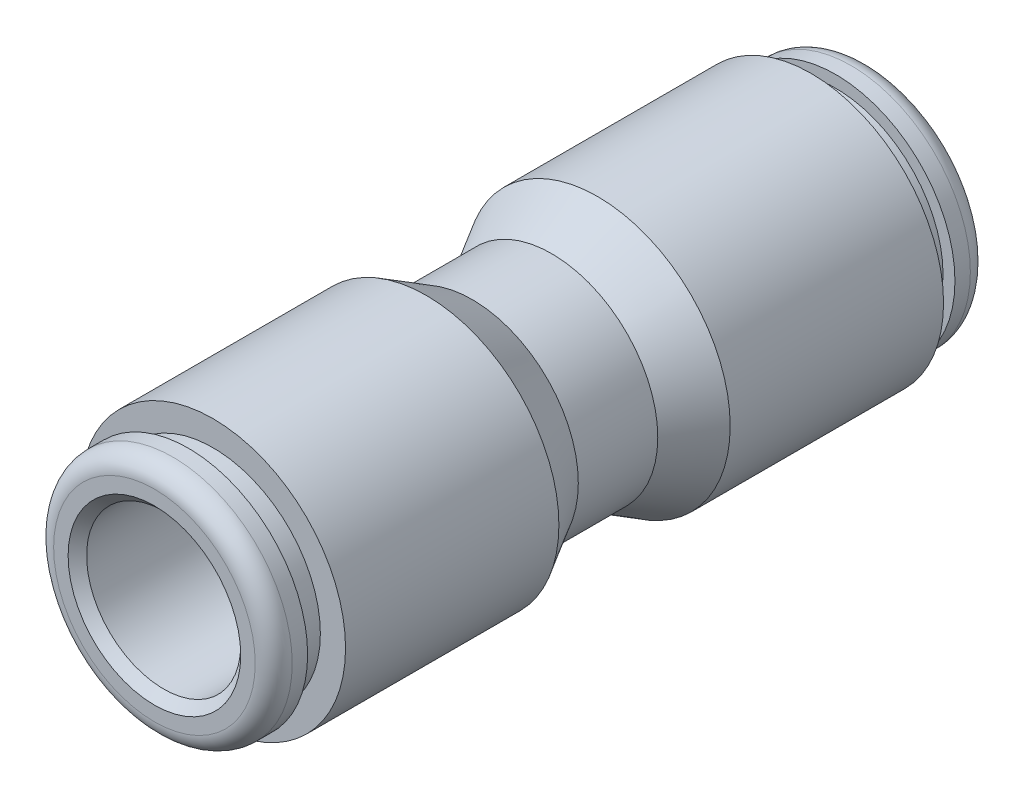
ISO-10303-21;
HEADER;
FILE_DESCRIPTION(('STEP AP214'),'2;1');
FILE_NAME('part.step','',(''),(''),'','','');
FILE_SCHEMA(('AUTOMOTIVE_DESIGN { 1 0 10303 214 1 1 1 1 }'));
ENDSEC;
DATA;
#1=APPLICATION_CONTEXT('core data for automotive mechanical design processes');
#2=APPLICATION_PROTOCOL_DEFINITION('international standard','automotive_design',2000,#1);
#3=PRODUCT_CONTEXT('',#1,'mechanical');
#4=PRODUCT('Part','Part','',(#3));
#5=PRODUCT_RELATED_PRODUCT_CATEGORY('part','',(#4));
#6=PRODUCT_DEFINITION_FORMATION('','',#4);
#7=PRODUCT_DEFINITION_CONTEXT('part definition',#1,'design');
#8=PRODUCT_DEFINITION('design','',#6,#7);
#9=PRODUCT_DEFINITION_SHAPE('','',#8);
#10=(LENGTH_UNIT() NAMED_UNIT(*) SI_UNIT(.MILLI.,.METRE.));
#11=(NAMED_UNIT(*) PLANE_ANGLE_UNIT() SI_UNIT($,.RADIAN.));
#12=(NAMED_UNIT(*) SI_UNIT($,.STERADIAN.) SOLID_ANGLE_UNIT());
#13=UNCERTAINTY_MEASURE_WITH_UNIT(LENGTH_MEASURE(1.E-05),#10,'distance_accuracy_value','');
#14=(GEOMETRIC_REPRESENTATION_CONTEXT(3) GLOBAL_UNCERTAINTY_ASSIGNED_CONTEXT((#13)) GLOBAL_UNIT_ASSIGNED_CONTEXT((#10,
#11,#12)) REPRESENTATION_CONTEXT('',''));
#15=CARTESIAN_POINT('',(0.,0.,0.));
#16=DIRECTION('',(0.,0.,1.));
#17=DIRECTION('',(1.,0.,0.));
#18=AXIS2_PLACEMENT_3D('',#15,#16,#17);
#19=CARTESIAN_POINT('',(0.,4.3688,0.));
#20=DIRECTION('',(0.,0.,-1.));
#21=DIRECTION('',(-1.,0.,0.));
#22=AXIS2_PLACEMENT_3D('',#19,#20,#21);
#23=PLANE('',#22);
#24=CARTESIAN_POINT('',(0.,0.,0.));
#25=DIRECTION('',(0.,0.,1.));
#26=DIRECTION('',(1.,0.,0.));
#27=AXIS2_PLACEMENT_3D('',#24,#25,#26);
#28=CIRCLE('',#27,2.413);
#29=CARTESIAN_POINT('',(2.413,0.,0.));
#30=VERTEX_POINT('',#29);
#31=EDGE_CURVE('E77',#30,#30,#28,.T.);
#32=ORIENTED_EDGE('',*,*,#31,.F.);
#33=EDGE_LOOP('',(#32));
#34=FACE_BOUND('',#33,.T.);
#35=CARTESIAN_POINT('',(0.,0.,0.));
#36=DIRECTION('',(0.,0.,-1.));
#37=DIRECTION('',(-1.,0.,0.));
#38=AXIS2_PLACEMENT_3D('',#35,#36,#37);
#39=CIRCLE('',#38,3.175);
#40=CARTESIAN_POINT('',(-3.175,0.,0.));
#41=VERTEX_POINT('',#40);
#42=EDGE_CURVE('E10',#41,#41,#39,.T.);
#43=ORIENTED_EDGE('',*,*,#42,.F.);
#44=EDGE_LOOP('',(#43));
#45=FACE_BOUND('',#44,.T.);
#46=ADVANCED_FACE('F30',(#34,#45),#23,.F.);
#47=CARTESIAN_POINT('',(0.,0.,0.));
#48=DIRECTION('',(0.,0.,1.));
#49=DIRECTION('',(1.,0.,0.));
#50=AXIS2_PLACEMENT_3D('',#47,#48,#49);
#51=CYLINDRICAL_SURFACE('',#50,3.175);
#52=CARTESIAN_POINT('',(0.,0.,-14.351));
#53=DIRECTION('',(0.,0.,1.));
#54=DIRECTION('',(1.,0.,0.));
#55=AXIS2_PLACEMENT_3D('',#52,#53,#54);
#56=CIRCLE('',#55,3.175);
#57=CARTESIAN_POINT('',(3.175,0.,-14.351));
#58=VERTEX_POINT('',#57);
#59=EDGE_CURVE('E71',#58,#58,#56,.T.);
#60=ORIENTED_EDGE('',*,*,#59,.F.);
#61=EDGE_LOOP('',(#60));
#62=FACE_BOUND('',#61,.T.);
#63=CARTESIAN_POINT('',(0.,0.,-1.016));
#64=DIRECTION('',(0.,0.,1.));
#65=DIRECTION('',(1.,0.,0.));
#66=AXIS2_PLACEMENT_3D('',#63,#64,#65);
#67=CIRCLE('',#66,3.175);
#68=CARTESIAN_POINT('',(3.175,0.,-1.016));
#69=VERTEX_POINT('',#68);
#70=EDGE_CURVE('E37',#69,#69,#67,.F.);
#71=ORIENTED_EDGE('',*,*,#70,.F.);
#72=EDGE_LOOP('',(#71));
#73=FACE_BOUND('',#72,.T.);
#74=ADVANCED_FACE('F32',(#62,#73),#51,.F.);
#75=CARTESIAN_POINT('',(0.,0.,0.));
#76=DIRECTION('',(0.,0.,1.));
#77=DIRECTION('',(1.,0.,0.));
#78=AXIS2_PLACEMENT_3D('',#75,#76,#77);
#79=CYLINDRICAL_SURFACE('',#78,4.3688);
#80=CARTESIAN_POINT('',(0.,0.,-1.63688888888889));
#81=DIRECTION('',(0.,0.,1.));
#82=DIRECTION('',(1.,0.,0.));
#83=AXIS2_PLACEMENT_3D('',#80,#81,#82);
#84=CIRCLE('',#83,4.3688);
#85=CARTESIAN_POINT('',(4.3688,0.,-1.63688888888889));
#86=VERTEX_POINT('',#85);
#87=EDGE_CURVE('E41',#86,#86,#84,.T.);
#88=ORIENTED_EDGE('',*,*,#87,.T.);
#89=EDGE_LOOP('',(#88));
#90=FACE_BOUND('',#89,.T.);
#91=CARTESIAN_POINT('',(0.,0.,1.63688888888889));
#92=DIRECTION('',(0.,0.,1.));
#93=DIRECTION('',(1.,0.,0.));
#94=AXIS2_PLACEMENT_3D('',#91,#92,#93);
#95=CIRCLE('',#94,4.3688);
#96=CARTESIAN_POINT('',(4.3688,0.,1.63688888888889));
#97=VERTEX_POINT('',#96);
#98=EDGE_CURVE('E80',#97,#97,#95,.T.);
#99=ORIENTED_EDGE('',*,*,#98,.F.);
#100=EDGE_LOOP('',(#99));
#101=FACE_BOUND('',#100,.T.);
#102=ADVANCED_FACE('F129',(#90,#101),#79,.T.);
#103=CARTESIAN_POINT('',(0.,0.,-3.52863478091561));
#104=DIRECTION('',(0.,0.,-1.));
#105=DIRECTION('',(-1.,0.,0.));
#106=AXIS2_PLACEMENT_3D('',#103,#104,#105);
#107=CONICAL_SURFACE('',#106,5.461,0.523598775598301);
#108=ORIENTED_EDGE('',*,*,#87,.F.);
#109=EDGE_LOOP('',(#108));
#110=FACE_BOUND('',#109,.T.);
#111=CARTESIAN_POINT('',(0.,0.,-3.52863478091561));
#112=DIRECTION('',(0.,0.,1.));
#113=DIRECTION('',(1.,0.,0.));
#114=AXIS2_PLACEMENT_3D('',#111,#112,#113);
#115=CIRCLE('',#114,5.461);
#116=CARTESIAN_POINT('',(5.461,0.,-3.52863478091561));
#117=VERTEX_POINT('',#116);
#118=EDGE_CURVE('E45',#117,#117,#115,.T.);
#119=ORIENTED_EDGE('',*,*,#118,.T.);
#120=EDGE_LOOP('',(#119));
#121=FACE_BOUND('',#120,.T.);
#122=ADVANCED_FACE('F136',(#110,#121),#107,.T.);
#123=CARTESIAN_POINT('',(0.,0.,0.));
#124=DIRECTION('',(0.,0.,1.));
#125=DIRECTION('',(1.,0.,0.));
#126=AXIS2_PLACEMENT_3D('',#123,#124,#125);
#127=CYLINDRICAL_SURFACE('',#126,5.461);
#128=ORIENTED_EDGE('',*,*,#118,.F.);
#129=EDGE_LOOP('',(#128));
#130=FACE_BOUND('',#129,.T.);
#131=CARTESIAN_POINT('',(0.,0.,-12.319));
#132=DIRECTION('',(0.,0.,1.));
#133=DIRECTION('',(1.,0.,0.));
#134=AXIS2_PLACEMENT_3D('',#131,#132,#133);
#135=CIRCLE('',#134,5.461);
#136=CARTESIAN_POINT('',(5.461,0.,-12.319));
#137=VERTEX_POINT('',#136);
#138=EDGE_CURVE('E50',#137,#137,#135,.T.);
#139=ORIENTED_EDGE('',*,*,#138,.T.);
#140=EDGE_LOOP('',(#139));
#141=FACE_BOUND('',#140,.T.);
#142=ADVANCED_FACE('F140',(#130,#141),#127,.T.);
#143=CARTESIAN_POINT('',(0.,5.461,-12.319));
#144=DIRECTION('',(0.,0.,1.));
#145=DIRECTION('',(1.,0.,0.));
#146=AXIS2_PLACEMENT_3D('',#143,#144,#145);
#147=PLANE('',#146);
#148=ORIENTED_EDGE('',*,*,#138,.F.);
#149=EDGE_LOOP('',(#148));
#150=FACE_BOUND('',#149,.T.);
#151=CARTESIAN_POINT('',(0.,0.,-12.319));
#152=DIRECTION('',(0.,0.,1.));
#153=DIRECTION('',(1.,0.,0.));
#154=AXIS2_PLACEMENT_3D('',#151,#152,#153);
#155=CIRCLE('',#154,4.42341);
#156=CARTESIAN_POINT('',(4.42341,0.,-12.319));
#157=VERTEX_POINT('',#156);
#158=EDGE_CURVE('E53',#157,#157,#155,.T.);
#159=ORIENTED_EDGE('',*,*,#158,.T.);
#160=EDGE_LOOP('',(#159));
#161=FACE_BOUND('',#160,.T.);
#162=ADVANCED_FACE('F144',(#150,#161),#147,.F.);
#163=CARTESIAN_POINT('',(0.,0.,0.));
#164=DIRECTION('',(0.,0.,1.));
#165=DIRECTION('',(1.,0.,0.));
#166=AXIS2_PLACEMENT_3D('',#163,#164,#165);
#167=CYLINDRICAL_SURFACE('',#166,4.42341);
#168=ORIENTED_EDGE('',*,*,#158,.F.);
#169=EDGE_LOOP('',(#168));
#170=FACE_BOUND('',#169,.T.);
#171=CARTESIAN_POINT('',(0.,0.,-13.335));
#172=DIRECTION('',(0.,0.,1.));
#173=DIRECTION('',(1.,0.,0.));
#174=AXIS2_PLACEMENT_3D('',#171,#172,#173);
#175=CIRCLE('',#174,4.42341);
#176=CARTESIAN_POINT('',(4.42341,0.,-13.335));
#177=VERTEX_POINT('',#176);
#178=EDGE_CURVE('E56',#177,#177,#175,.T.);
#179=ORIENTED_EDGE('',*,*,#178,.T.);
#180=EDGE_LOOP('',(#179));
#181=FACE_BOUND('',#180,.T.);
#182=ADVANCED_FACE('F148',(#170,#181),#167,.T.);
#183=CARTESIAN_POINT('',(0.,4.9149,-13.335));
#184=DIRECTION('',(0.,0.,-1.));
#185=DIRECTION('',(-1.,0.,0.));
#186=AXIS2_PLACEMENT_3D('',#183,#184,#185);
#187=PLANE('',#186);
#188=ORIENTED_EDGE('',*,*,#178,.F.);
#189=EDGE_LOOP('',(#188));
#190=FACE_BOUND('',#189,.T.);
#191=CARTESIAN_POINT('',(0.,0.,-13.335));
#192=DIRECTION('',(0.,0.,1.));
#193=DIRECTION('',(1.,0.,0.));
#194=AXIS2_PLACEMENT_3D('',#191,#192,#193);
#195=CIRCLE('',#194,4.9149);
#196=CARTESIAN_POINT('',(4.9149,0.,-13.335));
#197=VERTEX_POINT('',#196);
#198=EDGE_CURVE('E59',#197,#197,#195,.T.);
#199=ORIENTED_EDGE('',*,*,#198,.T.);
#200=EDGE_LOOP('',(#199));
#201=FACE_BOUND('',#200,.T.);
#202=ADVANCED_FACE('F152',(#190,#201),#187,.F.);
#203=CARTESIAN_POINT('',(0.,0.,0.));
#204=DIRECTION('',(0.,0.,1.));
#205=DIRECTION('',(1.,0.,0.));
#206=AXIS2_PLACEMENT_3D('',#203,#204,#205);
#207=CYLINDRICAL_SURFACE('',#206,4.9149);
#208=ORIENTED_EDGE('',*,*,#198,.F.);
#209=EDGE_LOOP('',(#208));
#210=FACE_BOUND('',#209,.T.);
#211=CARTESIAN_POINT('',(0.,0.,-13.97));
#212=DIRECTION('',(0.,0.,1.));
#213=DIRECTION('',(1.,0.,0.));
#214=AXIS2_PLACEMENT_3D('',#211,#212,#213);
#215=CIRCLE('',#214,4.9149);
#216=CARTESIAN_POINT('',(4.9149,0.,-13.97));
#217=VERTEX_POINT('',#216);
#218=EDGE_CURVE('E62',#217,#217,#215,.T.);
#219=ORIENTED_EDGE('',*,*,#218,.T.);
#220=EDGE_LOOP('',(#219));
#221=FACE_BOUND('',#220,.T.);
#222=ADVANCED_FACE('F156',(#210,#221),#207,.T.);
#223=CARTESIAN_POINT('',(0.,0.,-13.97));
#224=DIRECTION('',(0.,0.,1.));
#225=DIRECTION('',(1.,0.,0.));
#226=AXIS2_PLACEMENT_3D('',#223,#224,#225);
#227=TOROIDAL_SURFACE('',#226,4.1529,0.762);
#228=ORIENTED_EDGE('',*,*,#218,.F.);
#229=EDGE_LOOP('',(#228));
#230=FACE_BOUND('',#229,.T.);
#231=CARTESIAN_POINT('',(0.,0.,-14.732));
#232=DIRECTION('',(0.,0.,1.));
#233=DIRECTION('',(1.,0.,0.));
#234=AXIS2_PLACEMENT_3D('',#231,#232,#233);
#235=CIRCLE('',#234,4.1529);
#236=CARTESIAN_POINT('',(4.1529,0.,-14.732));
#237=VERTEX_POINT('',#236);
#238=EDGE_CURVE('E65',#237,#237,#235,.T.);
#239=ORIENTED_EDGE('',*,*,#238,.T.);
#240=EDGE_LOOP('',(#239));
#241=FACE_BOUND('',#240,.T.);
#242=ADVANCED_FACE('F160',(#230,#241),#227,.T.);
#243=CARTESIAN_POINT('',(0.,4.1529,-14.732));
#244=DIRECTION('',(0.,0.,1.));
#245=DIRECTION('',(1.,0.,0.));
#246=AXIS2_PLACEMENT_3D('',#243,#244,#245);
#247=PLANE('',#246);
#248=ORIENTED_EDGE('',*,*,#238,.F.);
#249=EDGE_LOOP('',(#248));
#250=FACE_BOUND('',#249,.T.);
#251=CARTESIAN_POINT('',(0.,0.,-14.732));
#252=DIRECTION('',(0.,0.,1.));
#253=DIRECTION('',(1.,0.,0.));
#254=AXIS2_PLACEMENT_3D('',#251,#252,#253);
#255=CIRCLE('',#254,3.556);
#256=CARTESIAN_POINT('',(3.556,0.,-14.732));
#257=VERTEX_POINT('',#256);
#258=EDGE_CURVE('E68',#257,#257,#255,.T.);
#259=ORIENTED_EDGE('',*,*,#258,.T.);
#260=EDGE_LOOP('',(#259));
#261=FACE_BOUND('',#260,.T.);
#262=ADVANCED_FACE('F164',(#250,#261),#247,.F.);
#263=CARTESIAN_POINT('',(0.,0.,-14.351));
#264=DIRECTION('',(0.,0.,-1.));
#265=DIRECTION('',(-1.,0.,0.));
#266=AXIS2_PLACEMENT_3D('',#263,#264,#265);
#267=CONICAL_SURFACE('',#266,3.175,0.785398163397449);
#268=ORIENTED_EDGE('',*,*,#258,.F.);
#269=EDGE_LOOP('',(#268));
#270=FACE_BOUND('',#269,.T.);
#271=ORIENTED_EDGE('',*,*,#59,.T.);
#272=EDGE_LOOP('',(#271));
#273=FACE_BOUND('',#272,.T.);
#274=ADVANCED_FACE('F168',(#270,#273),#267,.F.);
#275=CARTESIAN_POINT('',(0.,0.,-1.016));
#276=DIRECTION('',(0.,0.,1.));
#277=DIRECTION('',(1.,0.,0.));
#278=AXIS2_PLACEMENT_3D('',#275,#276,#277);
#279=PLANE('',#278);
#280=CARTESIAN_POINT('',(0.,0.,-1.016));
#281=DIRECTION('',(0.,0.,1.));
#282=DIRECTION('',(1.,0.,0.));
#283=AXIS2_PLACEMENT_3D('',#280,#281,#282);
#284=CIRCLE('',#283,2.413);
#285=CARTESIAN_POINT('',(2.413,0.,-1.016));
#286=VERTEX_POINT('',#285);
#287=EDGE_CURVE('E74',#286,#286,#284,.T.);
#288=ORIENTED_EDGE('',*,*,#287,.T.);
#289=EDGE_LOOP('',(#288));
#290=FACE_BOUND('',#289,.T.);
#291=ORIENTED_EDGE('',*,*,#70,.T.);
#292=EDGE_LOOP('',(#291));
#293=FACE_BOUND('',#292,.T.);
#294=ADVANCED_FACE('F172',(#290,#293),#279,.F.);
#295=CARTESIAN_POINT('',(0.,0.,-1.016));
#296=DIRECTION('',(0.,0.,1.));
#297=DIRECTION('',(1.,0.,0.));
#298=AXIS2_PLACEMENT_3D('',#295,#296,#297);
#299=CYLINDRICAL_SURFACE('',#298,2.413);
#300=ORIENTED_EDGE('',*,*,#287,.F.);
#301=EDGE_LOOP('',(#300));
#302=FACE_BOUND('',#301,.T.);
#303=ORIENTED_EDGE('',*,*,#31,.T.);
#304=EDGE_LOOP('',(#303));
#305=FACE_BOUND('',#304,.T.);
#306=ADVANCED_FACE('F176',(#302,#305),#299,.F.);
#307=CARTESIAN_POINT('',(0.,0.,0.));
#308=DIRECTION('',(0.,0.,-1.));
#309=DIRECTION('',(1.,0.,0.));
#310=AXIS2_PLACEMENT_3D('',#307,#308,#309);
#311=CYLINDRICAL_SURFACE('',#310,3.175);
#312=CARTESIAN_POINT('',(0.,0.,14.351));
#313=DIRECTION('',(0.,0.,1.));
#314=DIRECTION('',(1.,0.,0.));
#315=AXIS2_PLACEMENT_3D('',#312,#313,#314);
#316=CIRCLE('',#315,3.175);
#317=CARTESIAN_POINT('',(3.175,0.,14.351));
#318=VERTEX_POINT('',#317);
#319=EDGE_CURVE('E107',#318,#318,#316,.T.);
#320=ORIENTED_EDGE('',*,*,#319,.T.);
#321=EDGE_LOOP('',(#320));
#322=FACE_BOUND('',#321,.T.);
#323=ORIENTED_EDGE('',*,*,#42,.T.);
#324=EDGE_LOOP('',(#323));
#325=FACE_BOUND('',#324,.T.);
#326=ADVANCED_FACE('F111',(#322,#325),#311,.F.);
#327=CARTESIAN_POINT('',(0.,0.,3.52863478091561));
#328=DIRECTION('',(0.,0.,1.));
#329=DIRECTION('',(-1.,0.,0.));
#330=AXIS2_PLACEMENT_3D('',#327,#328,#329);
#331=CONICAL_SURFACE('',#330,5.461,0.523598775598301);
#332=ORIENTED_EDGE('',*,*,#98,.T.);
#333=EDGE_LOOP('',(#332));
#334=FACE_BOUND('',#333,.T.);
#335=CARTESIAN_POINT('',(0.,0.,3.52863478091561));
#336=DIRECTION('',(0.,0.,1.));
#337=DIRECTION('',(1.,0.,0.));
#338=AXIS2_PLACEMENT_3D('',#335,#336,#337);
#339=CIRCLE('',#338,5.461);
#340=CARTESIAN_POINT('',(5.461,0.,3.52863478091561));
#341=VERTEX_POINT('',#340);
#342=EDGE_CURVE('E83',#341,#341,#339,.T.);
#343=ORIENTED_EDGE('',*,*,#342,.F.);
#344=EDGE_LOOP('',(#343));
#345=FACE_BOUND('',#344,.T.);
#346=ADVANCED_FACE('F183',(#334,#345),#331,.T.);
#347=CARTESIAN_POINT('',(0.,0.,0.));
#348=DIRECTION('',(0.,0.,-1.));
#349=DIRECTION('',(1.,0.,0.));
#350=AXIS2_PLACEMENT_3D('',#347,#348,#349);
#351=CYLINDRICAL_SURFACE('',#350,5.461);
#352=ORIENTED_EDGE('',*,*,#342,.T.);
#353=EDGE_LOOP('',(#352));
#354=FACE_BOUND('',#353,.T.);
#355=CARTESIAN_POINT('',(0.,0.,12.319));
#356=DIRECTION('',(0.,0.,1.));
#357=DIRECTION('',(1.,0.,0.));
#358=AXIS2_PLACEMENT_3D('',#355,#356,#357);
#359=CIRCLE('',#358,5.461);
#360=CARTESIAN_POINT('',(5.461,0.,12.319));
#361=VERTEX_POINT('',#360);
#362=EDGE_CURVE('E86',#361,#361,#359,.T.);
#363=ORIENTED_EDGE('',*,*,#362,.F.);
#364=EDGE_LOOP('',(#363));
#365=FACE_BOUND('',#364,.T.);
#366=ADVANCED_FACE('F186',(#354,#365),#351,.T.);
#367=CARTESIAN_POINT('',(0.,5.461,12.319));
#368=DIRECTION('',(0.,0.,-1.));
#369=DIRECTION('',(1.,0.,0.));
#370=AXIS2_PLACEMENT_3D('',#367,#368,#369);
#371=PLANE('',#370);
#372=ORIENTED_EDGE('',*,*,#362,.T.);
#373=EDGE_LOOP('',(#372));
#374=FACE_BOUND('',#373,.T.);
#375=CARTESIAN_POINT('',(0.,0.,12.319));
#376=DIRECTION('',(0.,0.,1.));
#377=DIRECTION('',(1.,0.,0.));
#378=AXIS2_PLACEMENT_3D('',#375,#376,#377);
#379=CIRCLE('',#378,4.42341);
#380=CARTESIAN_POINT('',(4.42341,0.,12.319));
#381=VERTEX_POINT('',#380);
#382=EDGE_CURVE('E89',#381,#381,#379,.T.);
#383=ORIENTED_EDGE('',*,*,#382,.F.);
#384=EDGE_LOOP('',(#383));
#385=FACE_BOUND('',#384,.T.);
#386=ADVANCED_FACE('F190',(#374,#385),#371,.F.);
#387=CARTESIAN_POINT('',(0.,0.,0.));
#388=DIRECTION('',(0.,0.,-1.));
#389=DIRECTION('',(1.,0.,0.));
#390=AXIS2_PLACEMENT_3D('',#387,#388,#389);
#391=CYLINDRICAL_SURFACE('',#390,4.42341);
#392=ORIENTED_EDGE('',*,*,#382,.T.);
#393=EDGE_LOOP('',(#392));
#394=FACE_BOUND('',#393,.T.);
#395=CARTESIAN_POINT('',(0.,0.,13.335));
#396=DIRECTION('',(0.,0.,1.));
#397=DIRECTION('',(1.,0.,0.));
#398=AXIS2_PLACEMENT_3D('',#395,#396,#397);
#399=CIRCLE('',#398,4.42341);
#400=CARTESIAN_POINT('',(4.42341,0.,13.335));
#401=VERTEX_POINT('',#400);
#402=EDGE_CURVE('E92',#401,#401,#399,.T.);
#403=ORIENTED_EDGE('',*,*,#402,.F.);
#404=EDGE_LOOP('',(#403));
#405=FACE_BOUND('',#404,.T.);
#406=ADVANCED_FACE('F194',(#394,#405),#391,.T.);
#407=CARTESIAN_POINT('',(0.,4.9149,13.335));
#408=DIRECTION('',(0.,0.,1.));
#409=DIRECTION('',(-1.,0.,0.));
#410=AXIS2_PLACEMENT_3D('',#407,#408,#409);
#411=PLANE('',#410);
#412=ORIENTED_EDGE('',*,*,#402,.T.);
#413=EDGE_LOOP('',(#412));
#414=FACE_BOUND('',#413,.T.);
#415=CARTESIAN_POINT('',(0.,0.,13.335));
#416=DIRECTION('',(0.,0.,1.));
#417=DIRECTION('',(1.,0.,0.));
#418=AXIS2_PLACEMENT_3D('',#415,#416,#417);
#419=CIRCLE('',#418,4.9149);
#420=CARTESIAN_POINT('',(4.9149,0.,13.335));
#421=VERTEX_POINT('',#420);
#422=EDGE_CURVE('E95',#421,#421,#419,.T.);
#423=ORIENTED_EDGE('',*,*,#422,.F.);
#424=EDGE_LOOP('',(#423));
#425=FACE_BOUND('',#424,.T.);
#426=ADVANCED_FACE('F198',(#414,#425),#411,.F.);
#427=CARTESIAN_POINT('',(0.,0.,0.));
#428=DIRECTION('',(0.,0.,-1.));
#429=DIRECTION('',(1.,0.,0.));
#430=AXIS2_PLACEMENT_3D('',#427,#428,#429);
#431=CYLINDRICAL_SURFACE('',#430,4.9149);
#432=ORIENTED_EDGE('',*,*,#422,.T.);
#433=EDGE_LOOP('',(#432));
#434=FACE_BOUND('',#433,.T.);
#435=CARTESIAN_POINT('',(0.,0.,13.97));
#436=DIRECTION('',(0.,0.,1.));
#437=DIRECTION('',(1.,0.,0.));
#438=AXIS2_PLACEMENT_3D('',#435,#436,#437);
#439=CIRCLE('',#438,4.9149);
#440=CARTESIAN_POINT('',(4.9149,0.,13.97));
#441=VERTEX_POINT('',#440);
#442=EDGE_CURVE('E98',#441,#441,#439,.T.);
#443=ORIENTED_EDGE('',*,*,#442,.F.);
#444=EDGE_LOOP('',(#443));
#445=FACE_BOUND('',#444,.T.);
#446=ADVANCED_FACE('F202',(#434,#445),#431,.T.);
#447=CARTESIAN_POINT('',(0.,0.,13.97));
#448=DIRECTION('',(0.,0.,-1.));
#449=DIRECTION('',(1.,0.,0.));
#450=AXIS2_PLACEMENT_3D('',#447,#448,#449);
#451=TOROIDAL_SURFACE('',#450,4.1529,0.762);
#452=ORIENTED_EDGE('',*,*,#442,.T.);
#453=EDGE_LOOP('',(#452));
#454=FACE_BOUND('',#453,.T.);
#455=CARTESIAN_POINT('',(0.,0.,14.732));
#456=DIRECTION('',(0.,0.,1.));
#457=DIRECTION('',(1.,0.,0.));
#458=AXIS2_PLACEMENT_3D('',#455,#456,#457);
#459=CIRCLE('',#458,4.1529);
#460=CARTESIAN_POINT('',(4.1529,0.,14.732));
#461=VERTEX_POINT('',#460);
#462=EDGE_CURVE('E101',#461,#461,#459,.T.);
#463=ORIENTED_EDGE('',*,*,#462,.F.);
#464=EDGE_LOOP('',(#463));
#465=FACE_BOUND('',#464,.T.);
#466=ADVANCED_FACE('F121',(#454,#465),#451,.T.);
#467=CARTESIAN_POINT('',(0.,4.1529,14.732));
#468=DIRECTION('',(0.,0.,-1.));
#469=DIRECTION('',(1.,0.,0.));
#470=AXIS2_PLACEMENT_3D('',#467,#468,#469);
#471=PLANE('',#470);
#472=ORIENTED_EDGE('',*,*,#462,.T.);
#473=EDGE_LOOP('',(#472));
#474=FACE_BOUND('',#473,.T.);
#475=CARTESIAN_POINT('',(0.,0.,14.732));
#476=DIRECTION('',(0.,0.,1.));
#477=DIRECTION('',(1.,0.,0.));
#478=AXIS2_PLACEMENT_3D('',#475,#476,#477);
#479=CIRCLE('',#478,3.556);
#480=CARTESIAN_POINT('',(3.556,0.,14.732));
#481=VERTEX_POINT('',#480);
#482=EDGE_CURVE('E104',#481,#481,#479,.T.);
#483=ORIENTED_EDGE('',*,*,#482,.F.);
#484=EDGE_LOOP('',(#483));
#485=FACE_BOUND('',#484,.T.);
#486=ADVANCED_FACE('F115',(#474,#485),#471,.F.);
#487=CARTESIAN_POINT('',(0.,0.,14.351));
#488=DIRECTION('',(0.,0.,1.));
#489=DIRECTION('',(-1.,0.,0.));
#490=AXIS2_PLACEMENT_3D('',#487,#488,#489);
#491=CONICAL_SURFACE('',#490,3.175,0.785398163397449);
#492=ORIENTED_EDGE('',*,*,#482,.T.);
#493=EDGE_LOOP('',(#492));
#494=FACE_BOUND('',#493,.T.);
#495=ORIENTED_EDGE('',*,*,#319,.F.);
#496=EDGE_LOOP('',(#495));
#497=FACE_BOUND('',#496,.T.);
#498=ADVANCED_FACE('F113',(#494,#497),#491,.F.);
#499=CLOSED_SHELL('',(#46,#74,#102,#122,#142,#162,#182,#202,#222,#242,#262,#274,#294,#306,#326,
#346,#366,#386,#406,#426,#446,#466,#486,#498));
#500=MANIFOLD_SOLID_BREP('B2',#499);
#501=ADVANCED_BREP_SHAPE_REPRESENTATION('',(#18,#500),#14);
#502=SHAPE_DEFINITION_REPRESENTATION(#9,#501);
ENDSEC;
END-ISO-10303-21;
